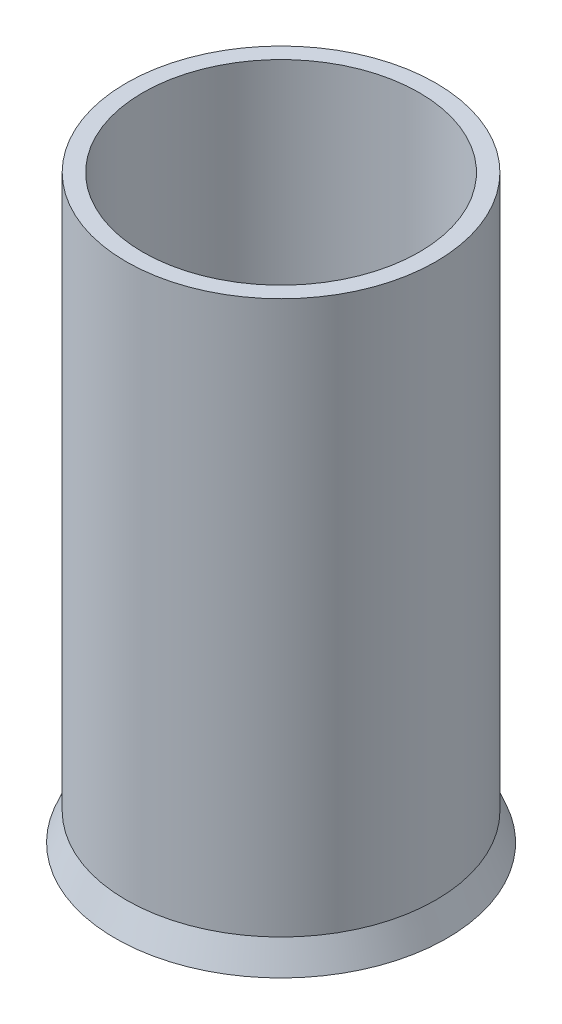
ISO-10303-21;
HEADER;
FILE_DESCRIPTION(('STEP AP214'),'2;1');
FILE_NAME('part.step','',(''),(''),'','','');
FILE_SCHEMA(('AUTOMOTIVE_DESIGN { 1 0 10303 214 1 1 1 1 }'));
ENDSEC;
DATA;
#1=APPLICATION_CONTEXT('core data for automotive mechanical design processes');
#2=APPLICATION_PROTOCOL_DEFINITION('international standard','automotive_design',2000,#1);
#3=PRODUCT_CONTEXT('',#1,'mechanical');
#4=PRODUCT('Part','Part','',(#3));
#5=PRODUCT_RELATED_PRODUCT_CATEGORY('part','',(#4));
#6=PRODUCT_DEFINITION_FORMATION('','',#4);
#7=PRODUCT_DEFINITION_CONTEXT('part definition',#1,'design');
#8=PRODUCT_DEFINITION('design','',#6,#7);
#9=PRODUCT_DEFINITION_SHAPE('','',#8);
#10=(LENGTH_UNIT() NAMED_UNIT(*) SI_UNIT(.MILLI.,.METRE.));
#11=(NAMED_UNIT(*) PLANE_ANGLE_UNIT() SI_UNIT($,.RADIAN.));
#12=(NAMED_UNIT(*) SI_UNIT($,.STERADIAN.) SOLID_ANGLE_UNIT());
#13=UNCERTAINTY_MEASURE_WITH_UNIT(LENGTH_MEASURE(1.E-05),#10,'distance_accuracy_value','');
#14=(GEOMETRIC_REPRESENTATION_CONTEXT(3) GLOBAL_UNCERTAINTY_ASSIGNED_CONTEXT((#13)) GLOBAL_UNIT_ASSIGNED_CONTEXT((#10,
#11,#12)) REPRESENTATION_CONTEXT('',''));
#15=CARTESIAN_POINT('',(0.,0.,0.));
#16=DIRECTION('',(0.,0.,1.));
#17=DIRECTION('',(1.,0.,0.));
#18=AXIS2_PLACEMENT_3D('',#15,#16,#17);
#19=CARTESIAN_POINT('',(0.,0.,0.));
#20=DIRECTION('',(0.,-1.,0.));
#21=DIRECTION('',(0.,0.,-1.));
#22=AXIS2_PLACEMENT_3D('',#19,#20,#21);
#23=CONICAL_SURFACE('',#22,28.,0.380506377112365);
#24=CARTESIAN_POINT('',(0.,0.,0.));
#25=DIRECTION('',(0.,1.,0.));
#26=DIRECTION('',(0.,0.,1.));
#27=AXIS2_PLACEMENT_3D('',#24,#25,#26);
#28=CIRCLE('',#27,28.);
#29=CARTESIAN_POINT('',(0.,0.,28.));
#30=VERTEX_POINT('',#29);
#31=EDGE_CURVE('E44',#30,#30,#28,.T.);
#32=ORIENTED_EDGE('',*,*,#31,.F.);
#33=EDGE_LOOP('',(#32));
#34=FACE_BOUND('',#33,.T.);
#35=CARTESIAN_POINT('',(0.,-5.,0.));
#36=DIRECTION('',(0.,-1.,0.));
#37=DIRECTION('',(0.,0.,-1.));
#38=AXIS2_PLACEMENT_3D('',#35,#36,#37);
#39=CIRCLE('',#38,30.);
#40=CARTESIAN_POINT('',(0.,-5.,-30.));
#41=VERTEX_POINT('',#40);
#42=EDGE_CURVE('E57',#41,#41,#39,.T.);
#43=ORIENTED_EDGE('',*,*,#42,.F.);
#44=EDGE_LOOP('',(#43));
#45=FACE_BOUND('',#44,.T.);
#46=ADVANCED_FACE('F40',(#34,#45),#23,.T.);
#47=CARTESIAN_POINT('',(0.,100.,0.));
#48=DIRECTION('',(0.,1.,0.));
#49=DIRECTION('',(0.,0.,1.));
#50=AXIS2_PLACEMENT_3D('',#47,#48,#49);
#51=PLANE('',#50);
#52=CARTESIAN_POINT('',(0.,100.,0.));
#53=DIRECTION('',(0.,1.,0.));
#54=DIRECTION('',(0.,0.,1.));
#55=AXIS2_PLACEMENT_3D('',#52,#53,#54);
#56=CIRCLE('',#55,28.);
#57=CARTESIAN_POINT('',(0.,100.,28.));
#58=VERTEX_POINT('',#57);
#59=EDGE_CURVE('E12',#58,#58,#56,.T.);
#60=ORIENTED_EDGE('',*,*,#59,.T.);
#61=EDGE_LOOP('',(#60));
#62=FACE_BOUND('',#61,.T.);
#63=CARTESIAN_POINT('',(0.,100.,0.));
#64=DIRECTION('',(0.,1.,0.));
#65=DIRECTION('',(0.,0.,1.));
#66=AXIS2_PLACEMENT_3D('',#63,#64,#65);
#67=CIRCLE('',#66,25.);
#68=CARTESIAN_POINT('',(0.,100.,25.));
#69=VERTEX_POINT('',#68);
#70=EDGE_CURVE('E48',#69,#69,#67,.T.);
#71=ORIENTED_EDGE('',*,*,#70,.F.);
#72=EDGE_LOOP('',(#71));
#73=FACE_BOUND('',#72,.T.);
#74=ADVANCED_FACE('F68',(#62,#73),#51,.T.);
#75=CARTESIAN_POINT('',(0.,100.,0.));
#76=DIRECTION('',(0.,-1.,0.));
#77=DIRECTION('',(0.,0.,-1.));
#78=AXIS2_PLACEMENT_3D('',#75,#76,#77);
#79=CYLINDRICAL_SURFACE('',#78,28.);
#80=ORIENTED_EDGE('',*,*,#59,.F.);
#81=EDGE_LOOP('',(#80));
#82=FACE_BOUND('',#81,.T.);
#83=ORIENTED_EDGE('',*,*,#31,.T.);
#84=EDGE_LOOP('',(#83));
#85=FACE_BOUND('',#84,.T.);
#86=ADVANCED_FACE('F64',(#82,#85),#79,.T.);
#87=CARTESIAN_POINT('',(0.,100.,0.));
#88=DIRECTION('',(0.,-1.,0.));
#89=DIRECTION('',(0.,0.,-1.));
#90=AXIS2_PLACEMENT_3D('',#87,#88,#89);
#91=CYLINDRICAL_SURFACE('',#90,25.);
#92=ORIENTED_EDGE('',*,*,#70,.T.);
#93=EDGE_LOOP('',(#92));
#94=FACE_BOUND('',#93,.T.);
#95=CARTESIAN_POINT('',(0.,0.,0.));
#96=DIRECTION('',(0.,1.,0.));
#97=DIRECTION('',(0.,0.,1.));
#98=AXIS2_PLACEMENT_3D('',#95,#96,#97);
#99=CIRCLE('',#98,25.);
#100=CARTESIAN_POINT('',(0.,0.,25.));
#101=VERTEX_POINT('',#100);
#102=EDGE_CURVE('E52',#101,#101,#99,.T.);
#103=ORIENTED_EDGE('',*,*,#102,.F.);
#104=EDGE_LOOP('',(#103));
#105=FACE_BOUND('',#104,.T.);
#106=ADVANCED_FACE('F76',(#94,#105),#91,.F.);
#107=CARTESIAN_POINT('',(0.,0.,0.));
#108=DIRECTION('',(0.,-1.,0.));
#109=DIRECTION('',(0.,0.,-1.));
#110=AXIS2_PLACEMENT_3D('',#107,#108,#109);
#111=PLANE('',#110);
#112=ORIENTED_EDGE('',*,*,#102,.T.);
#113=EDGE_LOOP('',(#112));
#114=FACE_BOUND('',#113,.T.);
#115=ADVANCED_FACE('F82',(#114),#111,.F.);
#116=CARTESIAN_POINT('',(0.,-5.,0.));
#117=DIRECTION('',(0.,-1.,0.));
#118=DIRECTION('',(0.,0.,-1.));
#119=AXIS2_PLACEMENT_3D('',#116,#117,#118);
#120=PLANE('',#119);
#121=ORIENTED_EDGE('',*,*,#42,.T.);
#122=EDGE_LOOP('',(#121));
#123=FACE_BOUND('',#122,.T.);
#124=ADVANCED_FACE('F86',(#123),#120,.T.);
#125=CLOSED_SHELL('',(#46,#74,#86,#106,#115,#124));
#126=MANIFOLD_SOLID_BREP('B2',#125);
#127=ADVANCED_BREP_SHAPE_REPRESENTATION('',(#18,#126),#14);
#128=SHAPE_DEFINITION_REPRESENTATION(#9,#127);
ENDSEC;
END-ISO-10303-21;
